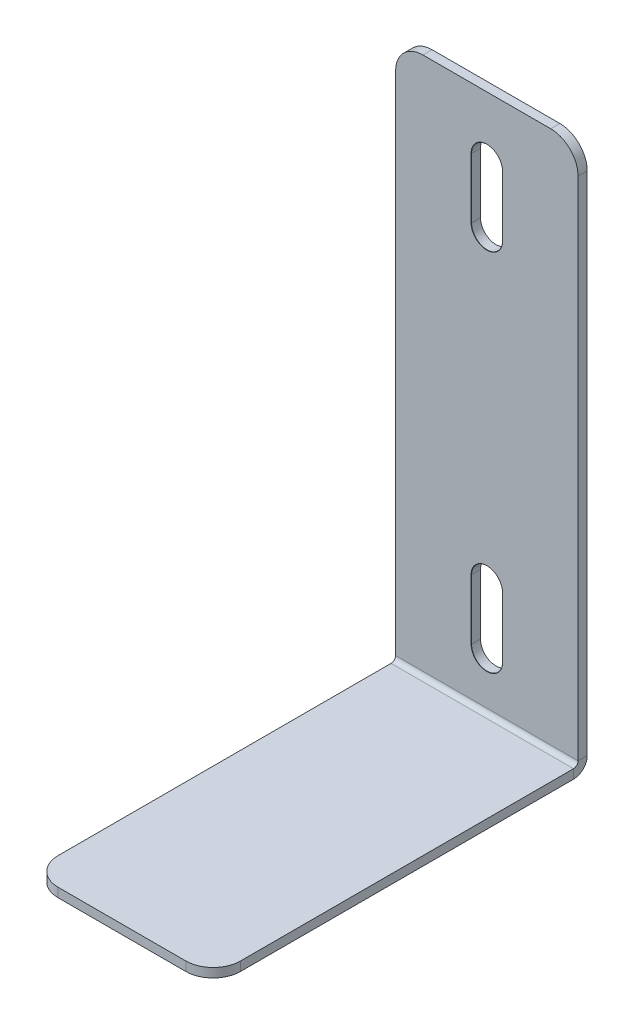
ISO-10303-21;
HEADER;
FILE_DESCRIPTION(('STEP AP214'),'2;1');
FILE_NAME('part.step','',(''),(''),'','','');
FILE_SCHEMA(('AUTOMOTIVE_DESIGN { 1 0 10303 214 1 1 1 1 }'));
ENDSEC;
DATA;
#1=APPLICATION_CONTEXT('core data for automotive mechanical design processes');
#2=APPLICATION_PROTOCOL_DEFINITION('international standard','automotive_design',2000,#1);
#3=PRODUCT_CONTEXT('',#1,'mechanical');
#4=PRODUCT('Part','Part','',(#3));
#5=PRODUCT_RELATED_PRODUCT_CATEGORY('part','',(#4));
#6=PRODUCT_DEFINITION_FORMATION('','',#4);
#7=PRODUCT_DEFINITION_CONTEXT('part definition',#1,'design');
#8=PRODUCT_DEFINITION('design','',#6,#7);
#9=PRODUCT_DEFINITION_SHAPE('','',#8);
#10=(LENGTH_UNIT() NAMED_UNIT(*) SI_UNIT(.MILLI.,.METRE.));
#11=(NAMED_UNIT(*) PLANE_ANGLE_UNIT() SI_UNIT($,.RADIAN.));
#12=(NAMED_UNIT(*) SI_UNIT($,.STERADIAN.) SOLID_ANGLE_UNIT());
#13=UNCERTAINTY_MEASURE_WITH_UNIT(LENGTH_MEASURE(1.E-05),#10,'distance_accuracy_value','');
#14=(GEOMETRIC_REPRESENTATION_CONTEXT(3) GLOBAL_UNCERTAINTY_ASSIGNED_CONTEXT((#13)) GLOBAL_UNIT_ASSIGNED_CONTEXT((#10,
#11,#12)) REPRESENTATION_CONTEXT('',''));
#15=CARTESIAN_POINT('',(0.,0.,0.));
#16=DIRECTION('',(0.,0.,1.));
#17=DIRECTION('',(1.,0.,0.));
#18=AXIS2_PLACEMENT_3D('',#15,#16,#17);
#19=CARTESIAN_POINT('',(0.,0.,0.));
#20=DIRECTION('',(0.,0.,1.));
#21=DIRECTION('',(1.,0.,0.));
#22=AXIS2_PLACEMENT_3D('',#19,#20,#21);
#23=PLANE('',#22);
#24=DIRECTION('',(0.,1.,0.));
#25=VECTOR('',#24,1.);
#26=CARTESIAN_POINT('',(-1.72500000000001,16.6999999999999,0.));
#27=LINE('',#26,#25);
#28=CARTESIAN_POINT('',(-1.72500000000006,16.6999999999999,0.));
#29=VERTEX_POINT('',#28);
#30=CARTESIAN_POINT('',(-1.72500000000001,23.2999999999999,0.));
#31=VERTEX_POINT('',#30);
#32=EDGE_CURVE('E403',#29,#31,#27,.T.);
#33=ORIENTED_EDGE('',*,*,#32,.T.);
#34=CARTESIAN_POINT('',(0.,23.2999999999999,0.));
#35=DIRECTION('',(0.,0.,1.));
#36=DIRECTION('',(1.,0.,0.));
#37=AXIS2_PLACEMENT_3D('',#34,#35,#36);
#38=CIRCLE('',#37,1.725);
#39=CARTESIAN_POINT('',(1.72499999999998,23.2999999999999,0.));
#40=VERTEX_POINT('',#39);
#41=EDGE_CURVE('E417',#40,#31,#38,.T.);
#42=ORIENTED_EDGE('',*,*,#41,.F.);
#43=DIRECTION('',(0.,1.,0.));
#44=VECTOR('',#43,1.);
#45=CARTESIAN_POINT('',(1.72499999999998,16.6999999999999,0.));
#46=LINE('',#45,#44);
#47=CARTESIAN_POINT('',(1.72499999999999,16.6999999999999,0.));
#48=VERTEX_POINT('',#47);
#49=EDGE_CURVE('E397',#48,#40,#46,.T.);
#50=ORIENTED_EDGE('',*,*,#49,.F.);
#51=CARTESIAN_POINT('',(0.,16.6999999999999,0.));
#52=DIRECTION('',(0.,0.,1.));
#53=DIRECTION('',(1.,0.,0.));
#54=AXIS2_PLACEMENT_3D('',#51,#52,#53);
#55=CIRCLE('',#54,1.725);
#56=EDGE_CURVE('E383',#29,#48,#55,.T.);
#57=ORIENTED_EDGE('',*,*,#56,.F.);
#58=EDGE_LOOP('',(#33,#42,#50,#57));
#59=FACE_BOUND('',#58,.T.);
#60=DIRECTION('',(0.,1.,0.));
#61=VECTOR('',#60,1.);
#62=CARTESIAN_POINT('',(9.99999999999999,30.,0.));
#63=LINE('',#62,#61);
#64=CARTESIAN_POINT('',(10.,-28.5,0.));
#65=VERTEX_POINT('',#64);
#66=CARTESIAN_POINT('',(9.99999999999999,27.,0.));
#67=VERTEX_POINT('',#66);
#68=EDGE_CURVE('E532',#65,#67,#63,.T.);
#69=ORIENTED_EDGE('',*,*,#68,.T.);
#70=CARTESIAN_POINT('',(6.99999999999999,27.,0.));
#71=DIRECTION('',(0.,0.,1.));
#72=DIRECTION('',(1.,0.,0.));
#73=AXIS2_PLACEMENT_3D('',#70,#71,#72);
#74=CIRCLE('',#73,3.);
#75=CARTESIAN_POINT('',(6.99999999999999,30.,0.));
#76=VERTEX_POINT('',#75);
#77=EDGE_CURVE('E573',#67,#76,#74,.T.);
#78=ORIENTED_EDGE('',*,*,#77,.T.);
#79=DIRECTION('',(-1.,0.,0.));
#80=VECTOR('',#79,1.);
#81=CARTESIAN_POINT('',(-10.,30.,0.));
#82=LINE('',#81,#80);
#83=CARTESIAN_POINT('',(-7.00000000000001,30.,0.));
#84=VERTEX_POINT('',#83);
#85=EDGE_CURVE('E547',#76,#84,#82,.T.);
#86=ORIENTED_EDGE('',*,*,#85,.T.);
#87=CARTESIAN_POINT('',(-7.00000000000001,27.,0.));
#88=DIRECTION('',(0.,0.,1.));
#89=DIRECTION('',(1.,0.,0.));
#90=AXIS2_PLACEMENT_3D('',#87,#88,#89);
#91=CIRCLE('',#90,3.);
#92=CARTESIAN_POINT('',(-10.,27.,0.));
#93=VERTEX_POINT('',#92);
#94=EDGE_CURVE('E571',#84,#93,#91,.T.);
#95=ORIENTED_EDGE('',*,*,#94,.T.);
#96=DIRECTION('',(0.,-1.,0.));
#97=VECTOR('',#96,1.);
#98=CARTESIAN_POINT('',(-10.,30.,0.));
#99=LINE('',#98,#97);
#100=CARTESIAN_POINT('',(-10.,-28.5,0.));
#101=VERTEX_POINT('',#100);
#102=EDGE_CURVE('E539',#93,#101,#99,.T.);
#103=ORIENTED_EDGE('',*,*,#102,.T.);
#104=DIRECTION('',(1.,0.,0.));
#105=VECTOR('',#104,1.);
#106=CARTESIAN_POINT('',(10.,-28.5,0.));
#107=LINE('',#106,#105);
#108=EDGE_CURVE('E524',#65,#101,#107,.F.);
#109=ORIENTED_EDGE('',*,*,#108,.F.);
#110=EDGE_LOOP('',(#69,#78,#86,#95,#103,#109));
#111=FACE_BOUND('',#110,.T.);
#112=CARTESIAN_POINT('',(0.,-23.3000000000001,0.));
#113=DIRECTION('',(0.,0.,1.));
#114=DIRECTION('',(1.,0.,0.));
#115=AXIS2_PLACEMENT_3D('',#112,#113,#114);
#116=CIRCLE('',#115,1.725);
#117=CARTESIAN_POINT('',(-1.72500000000006,-23.3000000000001,0.));
#118=VERTEX_POINT('',#117);
#119=CARTESIAN_POINT('',(1.72499999999999,-23.3000000000001,0.));
#120=VERTEX_POINT('',#119);
#121=EDGE_CURVE('E452',#118,#120,#116,.T.);
#122=ORIENTED_EDGE('',*,*,#121,.F.);
#123=DIRECTION('',(0.,1.,0.));
#124=VECTOR('',#123,1.);
#125=CARTESIAN_POINT('',(-1.72500000000001,-23.3000000000001,0.));
#126=LINE('',#125,#124);
#127=CARTESIAN_POINT('',(-1.72500000000001,-16.7000000000001,0.));
#128=VERTEX_POINT('',#127);
#129=EDGE_CURVE('E440',#118,#128,#126,.T.);
#130=ORIENTED_EDGE('',*,*,#129,.T.);
#131=CARTESIAN_POINT('',(0.,-16.7000000000001,0.));
#132=DIRECTION('',(0.,0.,1.));
#133=DIRECTION('',(1.,0.,0.));
#134=AXIS2_PLACEMENT_3D('',#131,#132,#133);
#135=CIRCLE('',#134,1.725);
#136=CARTESIAN_POINT('',(1.72499999999998,-16.7000000000001,0.));
#137=VERTEX_POINT('',#136);
#138=EDGE_CURVE('E472',#137,#128,#135,.T.);
#139=ORIENTED_EDGE('',*,*,#138,.F.);
#140=DIRECTION('',(0.,1.,0.));
#141=VECTOR('',#140,1.);
#142=CARTESIAN_POINT('',(1.72499999999998,-23.3000000000001,0.));
#143=LINE('',#142,#141);
#144=EDGE_CURVE('E428',#120,#137,#143,.T.);
#145=ORIENTED_EDGE('',*,*,#144,.F.);
#146=EDGE_LOOP('',(#122,#130,#139,#145));
#147=FACE_BOUND('',#146,.T.);
#148=ADVANCED_FACE('F213',(#59,#111,#147),#23,.T.);
#149=CARTESIAN_POINT('',(9.99999999999999,30.,-1.));
#150=DIRECTION('',(1.,0.,0.));
#151=DIRECTION('',(0.,1.,0.));
#152=AXIS2_PLACEMENT_3D('',#149,#150,#151);
#153=PLANE('',#152);
#154=DIRECTION('',(0.,1.,0.));
#155=VECTOR('',#154,1.);
#156=CARTESIAN_POINT('',(9.99999999999999,30.,-1.));
#157=LINE('',#156,#155);
#158=CARTESIAN_POINT('',(10.,-28.5,-1.));
#159=VERTEX_POINT('',#158);
#160=CARTESIAN_POINT('',(9.99999999999999,27.,-1.));
#161=VERTEX_POINT('',#160);
#162=EDGE_CURVE('E535',#159,#161,#157,.T.);
#163=ORIENTED_EDGE('',*,*,#162,.T.);
#164=DIRECTION('',(0.,0.,1.));
#165=VECTOR('',#164,1.);
#166=CARTESIAN_POINT('',(9.99999999999999,27.,-1.));
#167=LINE('',#166,#165);
#168=EDGE_CURVE('E568',#161,#67,#167,.T.);
#169=ORIENTED_EDGE('',*,*,#168,.T.);
#170=ORIENTED_EDGE('',*,*,#68,.F.);
#171=DIRECTION('',(0.,0.,-1.));
#172=VECTOR('',#171,1.);
#173=CARTESIAN_POINT('',(10.,-28.5,0.));
#174=LINE('',#173,#172);
#175=EDGE_CURVE('E518',#65,#159,#174,.T.);
#176=ORIENTED_EDGE('',*,*,#175,.T.);
#177=EDGE_LOOP('',(#163,#169,#170,#176));
#178=FACE_BOUND('',#177,.T.);
#179=ADVANCED_FACE('F589',(#178),#153,.T.);
#180=CARTESIAN_POINT('',(0.,0.,-1.));
#181=DIRECTION('',(0.,0.,1.));
#182=DIRECTION('',(1.,0.,0.));
#183=AXIS2_PLACEMENT_3D('',#180,#181,#182);
#184=PLANE('',#183);
#185=DIRECTION('',(0.,1.,0.));
#186=VECTOR('',#185,1.);
#187=CARTESIAN_POINT('',(-1.69999999999999,16.6999999999999,-1.));
#188=LINE('',#187,#186);
#189=CARTESIAN_POINT('',(-1.69999999999999,16.6999999999999,-1.));
#190=VERTEX_POINT('',#189);
#191=CARTESIAN_POINT('',(-1.7,23.2999999999999,-1.));
#192=VERTEX_POINT('',#191);
#193=EDGE_CURVE('E976',#190,#192,#188,.T.);
#194=ORIENTED_EDGE('',*,*,#193,.F.);
#195=CARTESIAN_POINT('',(0.,16.6999999999999,-1.));
#196=DIRECTION('',(0.,0.,1.));
#197=DIRECTION('',(1.,0.,0.));
#198=AXIS2_PLACEMENT_3D('',#195,#196,#197);
#199=CIRCLE('',#198,1.69999999999999);
#200=CARTESIAN_POINT('',(1.69999999999998,16.6999999999999,-1.));
#201=VERTEX_POINT('',#200);
#202=EDGE_CURVE('E236',#190,#201,#199,.T.);
#203=ORIENTED_EDGE('',*,*,#202,.T.);
#204=DIRECTION('',(0.,1.,0.));
#205=VECTOR('',#204,1.);
#206=CARTESIAN_POINT('',(1.69999999999998,16.6999999999999,-1.));
#207=LINE('',#206,#205);
#208=CARTESIAN_POINT('',(1.69999999999998,23.2999999999999,-1.));
#209=VERTEX_POINT('',#208);
#210=EDGE_CURVE('E382',#201,#209,#207,.T.);
#211=ORIENTED_EDGE('',*,*,#210,.T.);
#212=CARTESIAN_POINT('',(0.,23.2999999999999,-1.));
#213=DIRECTION('',(0.,0.,1.));
#214=DIRECTION('',(1.,0.,0.));
#215=AXIS2_PLACEMENT_3D('',#212,#213,#214);
#216=CIRCLE('',#215,1.69999999999999);
#217=EDGE_CURVE('E423',#209,#192,#216,.T.);
#218=ORIENTED_EDGE('',*,*,#217,.T.);
#219=EDGE_LOOP('',(#194,#203,#211,#218));
#220=FACE_BOUND('',#219,.T.);
#221=CARTESIAN_POINT('',(0.,-23.3000000000001,-1.));
#222=DIRECTION('',(0.,0.,1.));
#223=DIRECTION('',(1.,0.,0.));
#224=AXIS2_PLACEMENT_3D('',#221,#222,#223);
#225=CIRCLE('',#224,1.69999999999999);
#226=CARTESIAN_POINT('',(-1.69999999999999,-23.3000000000001,-1.));
#227=VERTEX_POINT('',#226);
#228=CARTESIAN_POINT('',(1.69999999999998,-23.3000000000001,-1.));
#229=VERTEX_POINT('',#228);
#230=EDGE_CURVE('E458',#227,#229,#225,.T.);
#231=ORIENTED_EDGE('',*,*,#230,.T.);
#232=DIRECTION('',(0.,1.,0.));
#233=VECTOR('',#232,1.);
#234=CARTESIAN_POINT('',(1.69999999999998,-23.3000000000001,-1.));
#235=LINE('',#234,#233);
#236=CARTESIAN_POINT('',(1.69999999999998,-16.7000000000001,-1.));
#237=VERTEX_POINT('',#236);
#238=EDGE_CURVE('E433',#229,#237,#235,.T.);
#239=ORIENTED_EDGE('',*,*,#238,.T.);
#240=CARTESIAN_POINT('',(0.,-16.7000000000001,-1.));
#241=DIRECTION('',(0.,0.,1.));
#242=DIRECTION('',(1.,0.,0.));
#243=AXIS2_PLACEMENT_3D('',#240,#241,#242);
#244=CIRCLE('',#243,1.69999999999999);
#245=CARTESIAN_POINT('',(-1.7,-16.7000000000001,-1.));
#246=VERTEX_POINT('',#245);
#247=EDGE_CURVE('E478',#237,#246,#244,.T.);
#248=ORIENTED_EDGE('',*,*,#247,.T.);
#249=DIRECTION('',(0.,1.,0.));
#250=VECTOR('',#249,1.);
#251=CARTESIAN_POINT('',(-1.69999999999999,-23.3000000000001,-1.));
#252=LINE('',#251,#250);
#253=EDGE_CURVE('E436',#227,#246,#252,.T.);
#254=ORIENTED_EDGE('',*,*,#253,.F.);
#255=EDGE_LOOP('',(#231,#239,#248,#254));
#256=FACE_BOUND('',#255,.T.);
#257=DIRECTION('',(-1.,0.,0.));
#258=VECTOR('',#257,1.);
#259=CARTESIAN_POINT('',(-10.,30.,-1.));
#260=LINE('',#259,#258);
#261=CARTESIAN_POINT('',(6.99999999999999,30.,-1.));
#262=VERTEX_POINT('',#261);
#263=CARTESIAN_POINT('',(-7.00000000000001,30.,-1.));
#264=VERTEX_POINT('',#263);
#265=EDGE_CURVE('E538',#262,#264,#260,.T.);
#266=ORIENTED_EDGE('',*,*,#265,.F.);
#267=CARTESIAN_POINT('',(6.99999999999999,27.,-1.));
#268=DIRECTION('',(0.,0.,1.));
#269=DIRECTION('',(1.,0.,0.));
#270=AXIS2_PLACEMENT_3D('',#267,#268,#269);
#271=CIRCLE('',#270,3.);
#272=EDGE_CURVE('E221',#262,#161,#271,.F.);
#273=ORIENTED_EDGE('',*,*,#272,.T.);
#274=ORIENTED_EDGE('',*,*,#162,.F.);
#275=DIRECTION('',(1.,0.,0.));
#276=VECTOR('',#275,1.);
#277=CARTESIAN_POINT('',(10.,-28.5,-1.));
#278=LINE('',#277,#276);
#279=CARTESIAN_POINT('',(-10.,-28.5,-1.));
#280=VERTEX_POINT('',#279);
#281=EDGE_CURVE('E511',#159,#280,#278,.F.);
#282=ORIENTED_EDGE('',*,*,#281,.T.);
#283=DIRECTION('',(0.,-1.,0.));
#284=VECTOR('',#283,1.);
#285=CARTESIAN_POINT('',(-10.,30.,-1.));
#286=LINE('',#285,#284);
#287=CARTESIAN_POINT('',(-10.,27.,-1.));
#288=VERTEX_POINT('',#287);
#289=EDGE_CURVE('E542',#288,#280,#286,.T.);
#290=ORIENTED_EDGE('',*,*,#289,.F.);
#291=CARTESIAN_POINT('',(-7.00000000000001,27.,-1.));
#292=DIRECTION('',(0.,0.,1.));
#293=DIRECTION('',(1.,0.,0.));
#294=AXIS2_PLACEMENT_3D('',#291,#292,#293);
#295=CIRCLE('',#294,3.);
#296=EDGE_CURVE('E580',#288,#264,#295,.F.);
#297=ORIENTED_EDGE('',*,*,#296,.T.);
#298=EDGE_LOOP('',(#266,#273,#274,#282,#290,#297));
#299=FACE_BOUND('',#298,.T.);
#300=ADVANCED_FACE('F584',(#220,#256,#299),#184,.F.);
#301=CARTESIAN_POINT('',(-10.,30.,-1.));
#302=DIRECTION('',(-1.,0.,0.));
#303=DIRECTION('',(0.,-1.,0.));
#304=AXIS2_PLACEMENT_3D('',#301,#302,#303);
#305=PLANE('',#304);
#306=ORIENTED_EDGE('',*,*,#102,.F.);
#307=DIRECTION('',(0.,0.,1.));
#308=VECTOR('',#307,1.);
#309=CARTESIAN_POINT('',(-10.,27.,-1.));
#310=LINE('',#309,#308);
#311=EDGE_CURVE('E14',#93,#288,#310,.F.);
#312=ORIENTED_EDGE('',*,*,#311,.T.);
#313=ORIENTED_EDGE('',*,*,#289,.T.);
#314=DIRECTION('',(0.,0.,-1.));
#315=VECTOR('',#314,1.);
#316=CARTESIAN_POINT('',(-10.,-28.5,0.));
#317=LINE('',#316,#315);
#318=EDGE_CURVE('E529',#101,#280,#317,.T.);
#319=ORIENTED_EDGE('',*,*,#318,.F.);
#320=EDGE_LOOP('',(#306,#312,#313,#319));
#321=FACE_BOUND('',#320,.T.);
#322=ADVANCED_FACE('F606',(#321),#305,.T.);
#323=CARTESIAN_POINT('',(-10.,30.,-1.));
#324=DIRECTION('',(0.,1.,0.));
#325=DIRECTION('',(0.,0.,1.));
#326=AXIS2_PLACEMENT_3D('',#323,#324,#325);
#327=PLANE('',#326);
#328=ORIENTED_EDGE('',*,*,#85,.F.);
#329=DIRECTION('',(0.,0.,1.));
#330=VECTOR('',#329,1.);
#331=CARTESIAN_POINT('',(6.99999999999999,30.,-1.));
#332=LINE('',#331,#330);
#333=EDGE_CURVE('E578',#76,#262,#332,.F.);
#334=ORIENTED_EDGE('',*,*,#333,.T.);
#335=ORIENTED_EDGE('',*,*,#265,.T.);
#336=DIRECTION('',(0.,0.,1.));
#337=VECTOR('',#336,1.);
#338=CARTESIAN_POINT('',(-7.00000000000001,30.,-1.));
#339=LINE('',#338,#337);
#340=EDGE_CURVE('E575',#264,#84,#339,.T.);
#341=ORIENTED_EDGE('',*,*,#340,.T.);
#342=EDGE_LOOP('',(#328,#334,#335,#341));
#343=FACE_BOUND('',#342,.T.);
#344=ADVANCED_FACE('F598',(#343),#327,.T.);
#345=CARTESIAN_POINT('',(-10.,-28.5,0.499999999999999));
#346=DIRECTION('',(-1.,0.,0.));
#347=DIRECTION('',(0.,0.,1.));
#348=AXIS2_PLACEMENT_3D('',#345,#346,#347);
#349=PLANE('',#348);
#350=DIRECTION('',(0.,1.,0.));
#351=VECTOR('',#350,1.);
#352=CARTESIAN_POINT('',(-10.,-30.,0.499999999999994));
#353=LINE('',#352,#351);
#354=CARTESIAN_POINT('',(-10.,-29.,0.499999999999997));
#355=VERTEX_POINT('',#354);
#356=CARTESIAN_POINT('',(-10.,-30.,0.499999999999994));
#357=VERTEX_POINT('',#356);
#358=EDGE_CURVE('E483',#355,#357,#353,.F.);
#359=ORIENTED_EDGE('',*,*,#358,.F.);
#360=CARTESIAN_POINT('',(-10.,-28.5,0.499999999999999));
#361=DIRECTION('',(1.,0.,0.));
#362=DIRECTION('',(0.,0.,-1.));
#363=AXIS2_PLACEMENT_3D('',#360,#361,#362);
#364=CIRCLE('',#363,0.5);
#365=EDGE_CURVE('E521',#101,#355,#364,.F.);
#366=ORIENTED_EDGE('',*,*,#365,.F.);
#367=ORIENTED_EDGE('',*,*,#318,.T.);
#368=CARTESIAN_POINT('',(-10.,-28.5,0.499999999999999));
#369=DIRECTION('',(1.,0.,0.));
#370=DIRECTION('',(0.,0.,-1.));
#371=AXIS2_PLACEMENT_3D('',#368,#369,#370);
#372=CIRCLE('',#371,1.5);
#373=EDGE_CURVE('E514',#280,#357,#372,.F.);
#374=ORIENTED_EDGE('',*,*,#373,.T.);
#375=EDGE_LOOP('',(#359,#366,#367,#374));
#376=FACE_BOUND('',#375,.T.);
#377=ADVANCED_FACE('F616',(#376),#349,.T.);
#378=CARTESIAN_POINT('',(10.,-28.5,0.499999999999999));
#379=DIRECTION('',(-1.,0.,0.));
#380=DIRECTION('',(0.,0.,1.));
#381=AXIS2_PLACEMENT_3D('',#378,#379,#380);
#382=PLANE('',#381);
#383=CARTESIAN_POINT('',(10.,-28.5,0.499999999999999));
#384=DIRECTION('',(1.,0.,0.));
#385=DIRECTION('',(0.,0.,-1.));
#386=AXIS2_PLACEMENT_3D('',#383,#384,#385);
#387=CIRCLE('',#386,0.5);
#388=CARTESIAN_POINT('',(10.,-29.,0.499999999999997));
#389=VERTEX_POINT('',#388);
#390=EDGE_CURVE('E486',#389,#65,#387,.T.);
#391=ORIENTED_EDGE('',*,*,#390,.F.);
#392=DIRECTION('',(0.,1.,0.));
#393=VECTOR('',#392,1.);
#394=CARTESIAN_POINT('',(10.,-29.,0.499999999999997));
#395=LINE('',#394,#393);
#396=CARTESIAN_POINT('',(10.,-30.,0.499999999999994));
#397=VERTEX_POINT('',#396);
#398=EDGE_CURVE('E504',#389,#397,#395,.F.);
#399=ORIENTED_EDGE('',*,*,#398,.T.);
#400=CARTESIAN_POINT('',(10.,-28.5,0.499999999999999));
#401=DIRECTION('',(1.,0.,0.));
#402=DIRECTION('',(0.,0.,-1.));
#403=AXIS2_PLACEMENT_3D('',#400,#401,#402);
#404=CIRCLE('',#403,1.5);
#405=EDGE_CURVE('E515',#397,#159,#404,.T.);
#406=ORIENTED_EDGE('',*,*,#405,.T.);
#407=ORIENTED_EDGE('',*,*,#175,.F.);
#408=EDGE_LOOP('',(#391,#399,#406,#407));
#409=FACE_BOUND('',#408,.T.);
#410=ADVANCED_FACE('F628',(#409),#382,.F.);
#411=CARTESIAN_POINT('',(10.,-28.5,0.499999999999999));
#412=DIRECTION('',(1.,0.,0.));
#413=DIRECTION('',(0.,-1.,0.));
#414=AXIS2_PLACEMENT_3D('',#411,#412,#413);
#415=CYLINDRICAL_SURFACE('',#414,1.5);
#416=ORIENTED_EDGE('',*,*,#281,.F.);
#417=ORIENTED_EDGE('',*,*,#405,.F.);
#418=DIRECTION('',(1.,0.,0.));
#419=VECTOR('',#418,1.);
#420=CARTESIAN_POINT('',(-10.,-30.,0.499999999999994));
#421=LINE('',#420,#419);
#422=EDGE_CURVE('E501',#397,#357,#421,.F.);
#423=ORIENTED_EDGE('',*,*,#422,.T.);
#424=ORIENTED_EDGE('',*,*,#373,.F.);
#425=EDGE_LOOP('',(#416,#417,#423,#424));
#426=FACE_BOUND('',#425,.T.);
#427=ADVANCED_FACE('F678',(#426),#415,.T.);
#428=CARTESIAN_POINT('',(10.,-28.5,0.499999999999999));
#429=DIRECTION('',(1.,0.,0.));
#430=DIRECTION('',(0.,-1.,0.));
#431=AXIS2_PLACEMENT_3D('',#428,#429,#430);
#432=CYLINDRICAL_SURFACE('',#431,0.5);
#433=ORIENTED_EDGE('',*,*,#108,.T.);
#434=ORIENTED_EDGE('',*,*,#365,.T.);
#435=DIRECTION('',(1.,0.,0.));
#436=VECTOR('',#435,1.);
#437=CARTESIAN_POINT('',(-10.,-29.,0.499999999999997));
#438=LINE('',#437,#436);
#439=EDGE_CURVE('E507',#355,#389,#438,.T.);
#440=ORIENTED_EDGE('',*,*,#439,.T.);
#441=ORIENTED_EDGE('',*,*,#390,.T.);
#442=EDGE_LOOP('',(#433,#434,#440,#441));
#443=FACE_BOUND('',#442,.T.);
#444=ADVANCED_FACE('F612',(#443),#432,.F.);
#445=CARTESIAN_POINT('',(10.,-30.0000000000001,40.));
#446=DIRECTION('',(-1.,0.,0.));
#447=DIRECTION('',(0.,0.,1.));
#448=AXIS2_PLACEMENT_3D('',#445,#446,#447);
#449=PLANE('',#448);
#450=DIRECTION('',(0.,0.,-1.));
#451=VECTOR('',#450,1.);
#452=CARTESIAN_POINT('',(10.,-29.0000000000001,40.));
#453=LINE('',#452,#451);
#454=CARTESIAN_POINT('',(10.,-29.0000000000001,37.));
#455=VERTEX_POINT('',#454);
#456=EDGE_CURVE('E498',#389,#455,#453,.F.);
#457=ORIENTED_EDGE('',*,*,#456,.T.);
#458=DIRECTION('',(0.,1.,0.));
#459=VECTOR('',#458,1.);
#460=CARTESIAN_POINT('',(10.,-30.0000000000001,37.));
#461=LINE('',#460,#459);
#462=CARTESIAN_POINT('',(10.,-30.0000000000001,37.));
#463=VERTEX_POINT('',#462);
#464=EDGE_CURVE('E559',#455,#463,#461,.F.);
#465=ORIENTED_EDGE('',*,*,#464,.T.);
#466=DIRECTION('',(0.,0.,1.));
#467=VECTOR('',#466,1.);
#468=CARTESIAN_POINT('',(10.,-30.,-1.08008570766446E-13));
#469=LINE('',#468,#467);
#470=EDGE_CURVE('E490',#397,#463,#469,.T.);
#471=ORIENTED_EDGE('',*,*,#470,.F.);
#472=ORIENTED_EDGE('',*,*,#398,.F.);
#473=EDGE_LOOP('',(#457,#465,#471,#472));
#474=FACE_BOUND('',#473,.T.);
#475=ADVANCED_FACE('F632',(#474),#449,.F.);
#476=CARTESIAN_POINT('',(-10.,-30.,0.));
#477=DIRECTION('',(1.,0.,0.));
#478=DIRECTION('',(0.,0.,-1.));
#479=AXIS2_PLACEMENT_3D('',#476,#477,#478);
#480=PLANE('',#479);
#481=DIRECTION('',(0.,0.,-1.));
#482=VECTOR('',#481,1.);
#483=CARTESIAN_POINT('',(-10.,-30.,-1.05840166421475E-13));
#484=LINE('',#483,#482);
#485=CARTESIAN_POINT('',(-9.99999999999999,-30.0000000000001,37.));
#486=VERTEX_POINT('',#485);
#487=EDGE_CURVE('E484',#486,#357,#484,.T.);
#488=ORIENTED_EDGE('',*,*,#487,.F.);
#489=DIRECTION('',(0.,1.,0.));
#490=VECTOR('',#489,1.);
#491=CARTESIAN_POINT('',(-9.99999999999999,-30.0000000000001,37.));
#492=LINE('',#491,#490);
#493=CARTESIAN_POINT('',(-9.99999999999999,-29.0000000000001,37.));
#494=VERTEX_POINT('',#493);
#495=EDGE_CURVE('E565',#486,#494,#492,.T.);
#496=ORIENTED_EDGE('',*,*,#495,.T.);
#497=DIRECTION('',(0.,0.,1.));
#498=VECTOR('',#497,1.);
#499=CARTESIAN_POINT('',(-10.,-29.,0.));
#500=LINE('',#499,#498);
#501=EDGE_CURVE('E493',#494,#355,#500,.F.);
#502=ORIENTED_EDGE('',*,*,#501,.T.);
#503=ORIENTED_EDGE('',*,*,#358,.T.);
#504=EDGE_LOOP('',(#488,#496,#502,#503));
#505=FACE_BOUND('',#504,.T.);
#506=ADVANCED_FACE('F619',(#505),#480,.F.);
#507=CARTESIAN_POINT('',(0.,-30.,-1.07574889897452E-13));
#508=DIRECTION('',(0.,1.,0.));
#509=DIRECTION('',(0.,0.,1.));
#510=AXIS2_PLACEMENT_3D('',#507,#508,#509);
#511=PLANE('',#510);
#512=ORIENTED_EDGE('',*,*,#470,.T.);
#513=CARTESIAN_POINT('',(7.,-30.0000000000001,37.));
#514=DIRECTION('',(0.,1.,0.));
#515=DIRECTION('',(0.,0.,1.));
#516=AXIS2_PLACEMENT_3D('',#513,#514,#515);
#517=CIRCLE('',#516,3.);
#518=CARTESIAN_POINT('',(7.,-30.0000000000001,40.));
#519=VERTEX_POINT('',#518);
#520=EDGE_CURVE('E563',#463,#519,#517,.F.);
#521=ORIENTED_EDGE('',*,*,#520,.T.);
#522=DIRECTION('',(-1.,0.,0.));
#523=VECTOR('',#522,1.);
#524=CARTESIAN_POINT('',(0.,-30.0000000000001,40.));
#525=LINE('',#524,#523);
#526=CARTESIAN_POINT('',(-7.,-30.0000000000001,40.));
#527=VERTEX_POINT('',#526);
#528=EDGE_CURVE('E487',#519,#527,#525,.T.);
#529=ORIENTED_EDGE('',*,*,#528,.T.);
#530=CARTESIAN_POINT('',(-7.,-30.0000000000001,37.));
#531=DIRECTION('',(0.,1.,0.));
#532=DIRECTION('',(0.,0.,1.));
#533=AXIS2_PLACEMENT_3D('',#530,#531,#532);
#534=CIRCLE('',#533,3.);
#535=EDGE_CURVE('E561',#527,#486,#534,.F.);
#536=ORIENTED_EDGE('',*,*,#535,.T.);
#537=ORIENTED_EDGE('',*,*,#487,.T.);
#538=ORIENTED_EDGE('',*,*,#422,.F.);
#539=EDGE_LOOP('',(#512,#521,#529,#536,#537,#538));
#540=FACE_BOUND('',#539,.T.);
#541=ADVANCED_FACE('F636',(#540),#511,.F.);
#542=CARTESIAN_POINT('',(0.,-29.,-1.04083408558608E-13));
#543=DIRECTION('',(0.,1.,0.));
#544=DIRECTION('',(0.,0.,1.));
#545=AXIS2_PLACEMENT_3D('',#542,#543,#544);
#546=PLANE('',#545);
#547=DIRECTION('',(1.,0.,0.));
#548=VECTOR('',#547,1.);
#549=CARTESIAN_POINT('',(-9.99999999999999,-29.0000000000001,40.));
#550=LINE('',#549,#548);
#551=CARTESIAN_POINT('',(7.,-29.0000000000001,40.));
#552=VERTEX_POINT('',#551);
#553=CARTESIAN_POINT('',(-7.,-29.0000000000001,40.));
#554=VERTEX_POINT('',#553);
#555=EDGE_CURVE('E495',#552,#554,#550,.F.);
#556=ORIENTED_EDGE('',*,*,#555,.F.);
#557=CARTESIAN_POINT('',(7.,-29.0000000000001,37.));
#558=DIRECTION('',(0.,1.,0.));
#559=DIRECTION('',(0.,0.,1.));
#560=AXIS2_PLACEMENT_3D('',#557,#558,#559);
#561=CIRCLE('',#560,3.);
#562=EDGE_CURVE('E557',#552,#455,#561,.T.);
#563=ORIENTED_EDGE('',*,*,#562,.T.);
#564=ORIENTED_EDGE('',*,*,#456,.F.);
#565=ORIENTED_EDGE('',*,*,#439,.F.);
#566=ORIENTED_EDGE('',*,*,#501,.F.);
#567=CARTESIAN_POINT('',(-7.,-29.0000000000001,37.));
#568=DIRECTION('',(0.,1.,0.));
#569=DIRECTION('',(0.,0.,1.));
#570=AXIS2_PLACEMENT_3D('',#567,#568,#569);
#571=CIRCLE('',#570,3.);
#572=EDGE_CURVE('E555',#494,#554,#571,.T.);
#573=ORIENTED_EDGE('',*,*,#572,.T.);
#574=EDGE_LOOP('',(#556,#563,#564,#565,#566,#573));
#575=FACE_BOUND('',#574,.T.);
#576=ADVANCED_FACE('F624',(#575),#546,.T.);
#577=CARTESIAN_POINT('',(-9.99999999999999,-30.0000000000001,40.));
#578=DIRECTION('',(0.,0.,-1.));
#579=DIRECTION('',(0.,1.,0.));
#580=AXIS2_PLACEMENT_3D('',#577,#578,#579);
#581=PLANE('',#580);
#582=ORIENTED_EDGE('',*,*,#528,.F.);
#583=DIRECTION('',(0.,1.,0.));
#584=VECTOR('',#583,1.);
#585=CARTESIAN_POINT('',(7.,-30.0000000000001,40.));
#586=LINE('',#585,#584);
#587=EDGE_CURVE('E552',#519,#552,#586,.T.);
#588=ORIENTED_EDGE('',*,*,#587,.T.);
#589=ORIENTED_EDGE('',*,*,#555,.T.);
#590=DIRECTION('',(0.,1.,0.));
#591=VECTOR('',#590,1.);
#592=CARTESIAN_POINT('',(-7.,-30.0000000000001,40.));
#593=LINE('',#592,#591);
#594=EDGE_CURVE('E544',#554,#527,#593,.F.);
#595=ORIENTED_EDGE('',*,*,#594,.T.);
#596=EDGE_LOOP('',(#582,#588,#589,#595));
#597=FACE_BOUND('',#596,.T.);
#598=ADVANCED_FACE('F642',(#597),#581,.F.);
#599=CARTESIAN_POINT('',(7.,-30.0000000000001,37.));
#600=DIRECTION('',(0.,1.,0.));
#601=DIRECTION('',(0.,0.,1.));
#602=AXIS2_PLACEMENT_3D('',#599,#600,#601);
#603=CYLINDRICAL_SURFACE('',#602,3.);
#604=ORIENTED_EDGE('',*,*,#520,.F.);
#605=ORIENTED_EDGE('',*,*,#464,.F.);
#606=ORIENTED_EDGE('',*,*,#562,.F.);
#607=ORIENTED_EDGE('',*,*,#587,.F.);
#608=EDGE_LOOP('',(#604,#605,#606,#607));
#609=FACE_BOUND('',#608,.T.);
#610=ADVANCED_FACE('F640',(#609),#603,.T.);
#611=CARTESIAN_POINT('',(-7.,-30.0000000000001,37.));
#612=DIRECTION('',(0.,1.,0.));
#613=DIRECTION('',(0.,0.,1.));
#614=AXIS2_PLACEMENT_3D('',#611,#612,#613);
#615=CYLINDRICAL_SURFACE('',#614,3.);
#616=ORIENTED_EDGE('',*,*,#535,.F.);
#617=ORIENTED_EDGE('',*,*,#594,.F.);
#618=ORIENTED_EDGE('',*,*,#572,.F.);
#619=ORIENTED_EDGE('',*,*,#495,.F.);
#620=EDGE_LOOP('',(#616,#617,#618,#619));
#621=FACE_BOUND('',#620,.T.);
#622=ADVANCED_FACE('F646',(#621),#615,.T.);
#623=CARTESIAN_POINT('',(6.99999999999999,27.,-1.));
#624=DIRECTION('',(0.,0.,1.));
#625=DIRECTION('',(1.,0.,0.));
#626=AXIS2_PLACEMENT_3D('',#623,#624,#625);
#627=CYLINDRICAL_SURFACE('',#626,3.);
#628=ORIENTED_EDGE('',*,*,#272,.F.);
#629=ORIENTED_EDGE('',*,*,#333,.F.);
#630=ORIENTED_EDGE('',*,*,#77,.F.);
#631=ORIENTED_EDGE('',*,*,#168,.F.);
#632=EDGE_LOOP('',(#628,#629,#630,#631));
#633=FACE_BOUND('',#632,.T.);
#634=ADVANCED_FACE('F593',(#633),#627,.T.);
#635=CARTESIAN_POINT('',(-7.00000000000001,27.,-1.));
#636=DIRECTION('',(0.,0.,1.));
#637=DIRECTION('',(1.,0.,0.));
#638=AXIS2_PLACEMENT_3D('',#635,#636,#637);
#639=CYLINDRICAL_SURFACE('',#638,3.);
#640=ORIENTED_EDGE('',*,*,#296,.F.);
#641=ORIENTED_EDGE('',*,*,#311,.F.);
#642=ORIENTED_EDGE('',*,*,#94,.F.);
#643=ORIENTED_EDGE('',*,*,#340,.F.);
#644=EDGE_LOOP('',(#640,#641,#642,#643));
#645=FACE_BOUND('',#644,.T.);
#646=ADVANCED_FACE('F215',(#645),#639,.T.);
#647=CARTESIAN_POINT('',(0.,-16.7000000000001,0.));
#648=DIRECTION('',(0.,0.,1.));
#649=DIRECTION('',(1.,0.,0.));
#650=AXIS2_PLACEMENT_3D('',#647,#648,#649);
#651=CYLINDRICAL_SURFACE('',#650,1.69999999999999);
#652=ORIENTED_EDGE('',*,*,#247,.F.);
#653=DIRECTION('',(0.,0.,-1.));
#654=VECTOR('',#653,1.);
#655=CARTESIAN_POINT('',(1.69999999999998,-16.7000000000001,-1.));
#656=LINE('',#655,#654);
#657=CARTESIAN_POINT('',(1.69999999999998,-16.7000000000001,-0.025000000000025));
#658=VERTEX_POINT('',#657);
#659=EDGE_CURVE('E469',#658,#237,#656,.T.);
#660=ORIENTED_EDGE('',*,*,#659,.F.);
#661=CARTESIAN_POINT('',(0.,-16.7000000000001,-0.025000000000025));
#662=DIRECTION('',(0.,0.,1.));
#663=DIRECTION('',(1.,0.,0.));
#664=AXIS2_PLACEMENT_3D('',#661,#662,#663);
#665=CIRCLE('',#664,1.69999999999999);
#666=CARTESIAN_POINT('',(-1.7,-16.7000000000001,-0.0250000000000248));
#667=VERTEX_POINT('',#666);
#668=EDGE_CURVE('E475',#658,#667,#665,.T.);
#669=ORIENTED_EDGE('',*,*,#668,.T.);
#670=DIRECTION('',(0.,0.,1.));
#671=VECTOR('',#670,1.);
#672=CARTESIAN_POINT('',(-1.7,-16.7000000000001,0.));
#673=LINE('',#672,#671);
#674=EDGE_CURVE('E463',#246,#667,#673,.T.);
#675=ORIENTED_EDGE('',*,*,#674,.F.);
#676=EDGE_LOOP('',(#652,#660,#669,#675));
#677=FACE_BOUND('',#676,.T.);
#678=ADVANCED_FACE('F694',(#677),#651,.F.);
#679=CARTESIAN_POINT('',(0.,-16.7000000000001,0.));
#680=DIRECTION('',(0.,0.,1.));
#681=DIRECTION('',(1.,0.,0.));
#682=AXIS2_PLACEMENT_3D('',#679,#680,#681);
#683=CONICAL_SURFACE('',#682,1.725,0.785398163397171);
#684=ORIENTED_EDGE('',*,*,#668,.F.);
#685=DIRECTION('',(-0.707106781186351,0.,-0.707106781186744));
#686=VECTOR('',#685,1.);
#687=CARTESIAN_POINT('',(1.69999999999998,-16.7000000000001,-0.025000000000025));
#688=LINE('',#687,#686);
#689=EDGE_CURVE('E466',#137,#658,#688,.T.);
#690=ORIENTED_EDGE('',*,*,#689,.F.);
#691=ORIENTED_EDGE('',*,*,#138,.T.);
#692=DIRECTION('',(0.707106781186351,0.,-0.707106781186744));
#693=VECTOR('',#692,1.);
#694=CARTESIAN_POINT('',(0.,-16.7000000000001,-1.72500000000096));
#695=LINE('',#694,#693);
#696=EDGE_CURVE('E481',#667,#128,#695,.F.);
#697=ORIENTED_EDGE('',*,*,#696,.F.);
#698=EDGE_LOOP('',(#684,#690,#691,#697));
#699=FACE_BOUND('',#698,.T.);
#700=ADVANCED_FACE('F697',(#699),#683,.F.);
#701=CARTESIAN_POINT('',(0.,-23.3000000000001,0.));
#702=DIRECTION('',(0.,0.,1.));
#703=DIRECTION('',(1.,0.,0.));
#704=AXIS2_PLACEMENT_3D('',#701,#702,#703);
#705=CYLINDRICAL_SURFACE('',#704,1.69999999999999);
#706=CARTESIAN_POINT('',(0.,-23.3000000000001,-0.025000000000025));
#707=DIRECTION('',(0.,0.,1.));
#708=DIRECTION('',(1.,0.,0.));
#709=AXIS2_PLACEMENT_3D('',#706,#707,#708);
#710=CIRCLE('',#709,1.69999999999999);
#711=CARTESIAN_POINT('',(-1.69999999999999,-23.3000000000001,-0.025000000000025));
#712=VERTEX_POINT('',#711);
#713=CARTESIAN_POINT('',(1.69999999999998,-23.3000000000001,-0.025000000000025));
#714=VERTEX_POINT('',#713);
#715=EDGE_CURVE('E455',#712,#714,#710,.T.);
#716=ORIENTED_EDGE('',*,*,#715,.T.);
#717=DIRECTION('',(0.,0.,-1.));
#718=VECTOR('',#717,1.);
#719=CARTESIAN_POINT('',(1.69999999999998,-23.3000000000001,-1.));
#720=LINE('',#719,#718);
#721=EDGE_CURVE('E449',#714,#229,#720,.T.);
#722=ORIENTED_EDGE('',*,*,#721,.T.);
#723=ORIENTED_EDGE('',*,*,#230,.F.);
#724=DIRECTION('',(0.,0.,1.));
#725=VECTOR('',#724,1.);
#726=CARTESIAN_POINT('',(-1.69999999999999,-23.3000000000001,0.));
#727=LINE('',#726,#725);
#728=EDGE_CURVE('E443',#712,#227,#727,.F.);
#729=ORIENTED_EDGE('',*,*,#728,.F.);
#730=EDGE_LOOP('',(#716,#722,#723,#729));
#731=FACE_BOUND('',#730,.T.);
#732=ADVANCED_FACE('F701',(#731),#705,.F.);
#733=CARTESIAN_POINT('',(0.,-23.3000000000001,0.));
#734=DIRECTION('',(0.,0.,1.));
#735=DIRECTION('',(1.,0.,0.));
#736=AXIS2_PLACEMENT_3D('',#733,#734,#735);
#737=CONICAL_SURFACE('',#736,1.725,0.785398163397171);
#738=ORIENTED_EDGE('',*,*,#121,.T.);
#739=DIRECTION('',(-0.707106781186351,0.,-0.707106781186744));
#740=VECTOR('',#739,1.);
#741=CARTESIAN_POINT('',(1.69999999999998,-23.3000000000001,-0.025000000000025));
#742=LINE('',#741,#740);
#743=EDGE_CURVE('E446',#120,#714,#742,.T.);
#744=ORIENTED_EDGE('',*,*,#743,.T.);
#745=ORIENTED_EDGE('',*,*,#715,.F.);
#746=DIRECTION('',(-0.707106781186351,0.,0.707106781186744));
#747=VECTOR('',#746,1.);
#748=CARTESIAN_POINT('',(0.,-23.3000000000001,-1.72500000000096));
#749=LINE('',#748,#747);
#750=EDGE_CURVE('E461',#118,#712,#749,.F.);
#751=ORIENTED_EDGE('',*,*,#750,.F.);
#752=EDGE_LOOP('',(#738,#744,#745,#751));
#753=FACE_BOUND('',#752,.T.);
#754=ADVANCED_FACE('F705',(#753),#737,.F.);
#755=CARTESIAN_POINT('',(0.,-23.3000000000001,-1.72500000000096));
#756=DIRECTION('',(-0.707106781186744,0.,-0.707106781186351));
#757=DIRECTION('',(-0.707106781186351,0.,0.707106781186744));
#758=AXIS2_PLACEMENT_3D('',#755,#756,#757);
#759=PLANE('',#758);
#760=ORIENTED_EDGE('',*,*,#696,.T.);
#761=ORIENTED_EDGE('',*,*,#129,.F.);
#762=ORIENTED_EDGE('',*,*,#750,.T.);
#763=DIRECTION('',(0.,1.,0.));
#764=VECTOR('',#763,1.);
#765=CARTESIAN_POINT('',(-1.69999999999999,-23.3000000000001,-0.0250000000000248));
#766=LINE('',#765,#764);
#767=EDGE_CURVE('E438',#712,#667,#766,.T.);
#768=ORIENTED_EDGE('',*,*,#767,.T.);
#769=EDGE_LOOP('',(#760,#761,#762,#768));
#770=FACE_BOUND('',#769,.T.);
#771=ADVANCED_FACE('F709',(#770),#759,.F.);
#772=CARTESIAN_POINT('',(-1.69999999999999,-23.3000000000001,0.));
#773=DIRECTION('',(-1.,0.,0.));
#774=DIRECTION('',(0.,-1.,0.));
#775=AXIS2_PLACEMENT_3D('',#772,#773,#774);
#776=PLANE('',#775);
#777=ORIENTED_EDGE('',*,*,#674,.T.);
#778=ORIENTED_EDGE('',*,*,#767,.F.);
#779=ORIENTED_EDGE('',*,*,#728,.T.);
#780=ORIENTED_EDGE('',*,*,#253,.T.);
#781=EDGE_LOOP('',(#777,#778,#779,#780));
#782=FACE_BOUND('',#781,.T.);
#783=ADVANCED_FACE('F713',(#782),#776,.F.);
#784=CARTESIAN_POINT('',(1.69999999999998,-23.3000000000001,-1.));
#785=DIRECTION('',(1.,0.,0.));
#786=DIRECTION('',(0.,1.,0.));
#787=AXIS2_PLACEMENT_3D('',#784,#785,#786);
#788=PLANE('',#787);
#789=ORIENTED_EDGE('',*,*,#659,.T.);
#790=ORIENTED_EDGE('',*,*,#238,.F.);
#791=ORIENTED_EDGE('',*,*,#721,.F.);
#792=DIRECTION('',(0.,1.,0.));
#793=VECTOR('',#792,1.);
#794=CARTESIAN_POINT('',(1.69999999999998,-23.3000000000001,-0.025000000000025));
#795=LINE('',#794,#793);
#796=EDGE_CURVE('E430',#714,#658,#795,.T.);
#797=ORIENTED_EDGE('',*,*,#796,.T.);
#798=EDGE_LOOP('',(#789,#790,#791,#797));
#799=FACE_BOUND('',#798,.T.);
#800=ADVANCED_FACE('F717',(#799),#788,.F.);
#801=CARTESIAN_POINT('',(1.69999999999998,-23.3000000000001,-0.025000000000025));
#802=DIRECTION('',(0.707106781186744,0.,-0.707106781186351));
#803=DIRECTION('',(-0.707106781186351,0.,-0.707106781186744));
#804=AXIS2_PLACEMENT_3D('',#801,#802,#803);
#805=PLANE('',#804);
#806=ORIENTED_EDGE('',*,*,#689,.T.);
#807=ORIENTED_EDGE('',*,*,#796,.F.);
#808=ORIENTED_EDGE('',*,*,#743,.F.);
#809=ORIENTED_EDGE('',*,*,#144,.T.);
#810=EDGE_LOOP('',(#806,#807,#808,#809));
#811=FACE_BOUND('',#810,.T.);
#812=ADVANCED_FACE('F721',(#811),#805,.F.);
#813=CARTESIAN_POINT('',(0.,23.2999999999999,0.));
#814=DIRECTION('',(0.,0.,1.));
#815=DIRECTION('',(1.,0.,0.));
#816=AXIS2_PLACEMENT_3D('',#813,#814,#815);
#817=CYLINDRICAL_SURFACE('',#816,1.69999999999999);
#818=ORIENTED_EDGE('',*,*,#217,.F.);
#819=DIRECTION('',(0.,0.,-1.));
#820=VECTOR('',#819,1.);
#821=CARTESIAN_POINT('',(1.69999999999998,23.2999999999999,-1.));
#822=LINE('',#821,#820);
#823=CARTESIAN_POINT('',(1.69999999999998,23.2999999999999,-0.025000000000025));
#824=VERTEX_POINT('',#823);
#825=EDGE_CURVE('E415',#824,#209,#822,.T.);
#826=ORIENTED_EDGE('',*,*,#825,.F.);
#827=CARTESIAN_POINT('',(0.,23.2999999999999,-0.025000000000025));
#828=DIRECTION('',(0.,0.,1.));
#829=DIRECTION('',(1.,0.,0.));
#830=AXIS2_PLACEMENT_3D('',#827,#828,#829);
#831=CIRCLE('',#830,1.69999999999999);
#832=CARTESIAN_POINT('',(-1.7,23.2999999999999,-0.0250000000000248));
#833=VERTEX_POINT('',#832);
#834=EDGE_CURVE('E420',#824,#833,#831,.T.);
#835=ORIENTED_EDGE('',*,*,#834,.T.);
#836=DIRECTION('',(0.,0.,1.));
#837=VECTOR('',#836,1.);
#838=CARTESIAN_POINT('',(-1.7,23.2999999999999,0.));
#839=LINE('',#838,#837);
#840=EDGE_CURVE('E411',#192,#833,#839,.T.);
#841=ORIENTED_EDGE('',*,*,#840,.F.);
#842=EDGE_LOOP('',(#818,#826,#835,#841));
#843=FACE_BOUND('',#842,.T.);
#844=ADVANCED_FACE('F725',(#843),#817,.F.);
#845=CARTESIAN_POINT('',(0.,23.2999999999999,0.));
#846=DIRECTION('',(0.,0.,1.));
#847=DIRECTION('',(1.,0.,0.));
#848=AXIS2_PLACEMENT_3D('',#845,#846,#847);
#849=CONICAL_SURFACE('',#848,1.725,0.785398163397171);
#850=ORIENTED_EDGE('',*,*,#834,.F.);
#851=DIRECTION('',(-0.707106781186351,0.,-0.707106781186744));
#852=VECTOR('',#851,1.);
#853=CARTESIAN_POINT('',(1.69999999999998,23.2999999999999,-0.025000000000025));
#854=LINE('',#853,#852);
#855=EDGE_CURVE('E396',#40,#824,#854,.T.);
#856=ORIENTED_EDGE('',*,*,#855,.F.);
#857=ORIENTED_EDGE('',*,*,#41,.T.);
#858=DIRECTION('',(0.707106781186351,0.,-0.707106781186744));
#859=VECTOR('',#858,1.);
#860=CARTESIAN_POINT('',(0.,23.2999999999999,-1.72500000000096));
#861=LINE('',#860,#859);
#862=EDGE_CURVE('E426',#833,#31,#861,.F.);
#863=ORIENTED_EDGE('',*,*,#862,.F.);
#864=EDGE_LOOP('',(#850,#856,#857,#863));
#865=FACE_BOUND('',#864,.T.);
#866=ADVANCED_FACE('F729',(#865),#849,.F.);
#867=CARTESIAN_POINT('',(0.,16.6999999999999,0.));
#868=DIRECTION('',(0.,0.,1.));
#869=DIRECTION('',(1.,0.,0.));
#870=AXIS2_PLACEMENT_3D('',#867,#868,#869);
#871=CYLINDRICAL_SURFACE('',#870,1.69999999999999);
#872=CARTESIAN_POINT('',(0.,16.6999999999999,-0.025000000000025));
#873=DIRECTION('',(0.,0.,1.));
#874=DIRECTION('',(1.,0.,0.));
#875=AXIS2_PLACEMENT_3D('',#872,#873,#874);
#876=CIRCLE('',#875,1.69999999999999);
#877=CARTESIAN_POINT('',(-1.69999999999999,16.6999999999999,-0.025000000000025));
#878=VERTEX_POINT('',#877);
#879=CARTESIAN_POINT('',(1.69999999999998,16.6999999999999,-0.025000000000025));
#880=VERTEX_POINT('',#879);
#881=EDGE_CURVE('E386',#878,#880,#876,.T.);
#882=ORIENTED_EDGE('',*,*,#881,.T.);
#883=DIRECTION('',(0.,0.,-1.));
#884=VECTOR('',#883,1.);
#885=CARTESIAN_POINT('',(1.69999999999998,16.6999999999999,-1.));
#886=LINE('',#885,#884);
#887=EDGE_CURVE('E375',#880,#201,#886,.T.);
#888=ORIENTED_EDGE('',*,*,#887,.T.);
#889=ORIENTED_EDGE('',*,*,#202,.F.);
#890=DIRECTION('',(0.,0.,1.));
#891=VECTOR('',#890,1.);
#892=CARTESIAN_POINT('',(-1.69999999999999,16.6999999999999,0.));
#893=LINE('',#892,#891);
#894=EDGE_CURVE('E388',#878,#190,#893,.F.);
#895=ORIENTED_EDGE('',*,*,#894,.F.);
#896=EDGE_LOOP('',(#882,#888,#889,#895));
#897=FACE_BOUND('',#896,.T.);
#898=ADVANCED_FACE('F387',(#897),#871,.F.);
#899=CARTESIAN_POINT('',(0.,16.6999999999999,0.));
#900=DIRECTION('',(0.,0.,1.));
#901=DIRECTION('',(1.,0.,0.));
#902=AXIS2_PLACEMENT_3D('',#899,#900,#901);
#903=CONICAL_SURFACE('',#902,1.725,0.785398163397171);
#904=ORIENTED_EDGE('',*,*,#56,.T.);
#905=DIRECTION('',(-0.707106781186351,0.,-0.707106781186744));
#906=VECTOR('',#905,1.);
#907=CARTESIAN_POINT('',(1.69999999999998,16.6999999999999,-0.025000000000025));
#908=LINE('',#907,#906);
#909=EDGE_CURVE('E228',#48,#880,#908,.T.);
#910=ORIENTED_EDGE('',*,*,#909,.T.);
#911=ORIENTED_EDGE('',*,*,#881,.F.);
#912=DIRECTION('',(-0.707106781186351,0.,0.707106781186744));
#913=VECTOR('',#912,1.);
#914=CARTESIAN_POINT('',(0.,16.6999999999999,-1.72500000000096));
#915=LINE('',#914,#913);
#916=EDGE_CURVE('E409',#29,#878,#915,.F.);
#917=ORIENTED_EDGE('',*,*,#916,.F.);
#918=EDGE_LOOP('',(#904,#910,#911,#917));
#919=FACE_BOUND('',#918,.T.);
#920=ADVANCED_FACE('F399',(#919),#903,.F.);
#921=CARTESIAN_POINT('',(0.,16.6999999999999,-1.72500000000096));
#922=DIRECTION('',(-0.707106781186744,0.,-0.707106781186351));
#923=DIRECTION('',(-0.707106781186351,0.,0.707106781186744));
#924=AXIS2_PLACEMENT_3D('',#921,#922,#923);
#925=PLANE('',#924);
#926=ORIENTED_EDGE('',*,*,#862,.T.);
#927=ORIENTED_EDGE('',*,*,#32,.F.);
#928=ORIENTED_EDGE('',*,*,#916,.T.);
#929=DIRECTION('',(0.,1.,0.));
#930=VECTOR('',#929,1.);
#931=CARTESIAN_POINT('',(-1.69999999999999,16.6999999999999,-0.0250000000000248));
#932=LINE('',#931,#930);
#933=EDGE_CURVE('E991',#878,#833,#932,.T.);
#934=ORIENTED_EDGE('',*,*,#933,.T.);
#935=EDGE_LOOP('',(#926,#927,#928,#934));
#936=FACE_BOUND('',#935,.T.);
#937=ADVANCED_FACE('F738',(#936),#925,.F.);
#938=CARTESIAN_POINT('',(-1.69999999999999,16.6999999999999,0.));
#939=DIRECTION('',(-1.,0.,0.));
#940=DIRECTION('',(0.,-1.,0.));
#941=AXIS2_PLACEMENT_3D('',#938,#939,#940);
#942=PLANE('',#941);
#943=ORIENTED_EDGE('',*,*,#840,.T.);
#944=ORIENTED_EDGE('',*,*,#933,.F.);
#945=ORIENTED_EDGE('',*,*,#894,.T.);
#946=ORIENTED_EDGE('',*,*,#193,.T.);
#947=EDGE_LOOP('',(#943,#944,#945,#946));
#948=FACE_BOUND('',#947,.T.);
#949=ADVANCED_FACE('F741',(#948),#942,.F.);
#950=CARTESIAN_POINT('',(1.69999999999998,16.6999999999999,-1.));
#951=DIRECTION('',(1.,0.,0.));
#952=DIRECTION('',(0.,1.,0.));
#953=AXIS2_PLACEMENT_3D('',#950,#951,#952);
#954=PLANE('',#953);
#955=ORIENTED_EDGE('',*,*,#825,.T.);
#956=ORIENTED_EDGE('',*,*,#210,.F.);
#957=ORIENTED_EDGE('',*,*,#887,.F.);
#958=DIRECTION('',(0.,1.,0.));
#959=VECTOR('',#958,1.);
#960=CARTESIAN_POINT('',(1.69999999999998,16.6999999999999,-0.025000000000025));
#961=LINE('',#960,#959);
#962=EDGE_CURVE('E379',#880,#824,#961,.T.);
#963=ORIENTED_EDGE('',*,*,#962,.T.);
#964=EDGE_LOOP('',(#955,#956,#957,#963));
#965=FACE_BOUND('',#964,.T.);
#966=ADVANCED_FACE('F378',(#965),#954,.F.);
#967=CARTESIAN_POINT('',(1.69999999999998,16.6999999999999,-0.025000000000025));
#968=DIRECTION('',(0.707106781186744,0.,-0.707106781186351));
#969=DIRECTION('',(-0.707106781186351,0.,-0.707106781186744));
#970=AXIS2_PLACEMENT_3D('',#967,#968,#969);
#971=PLANE('',#970);
#972=ORIENTED_EDGE('',*,*,#855,.T.);
#973=ORIENTED_EDGE('',*,*,#962,.F.);
#974=ORIENTED_EDGE('',*,*,#909,.F.);
#975=ORIENTED_EDGE('',*,*,#49,.T.);
#976=EDGE_LOOP('',(#972,#973,#974,#975));
#977=FACE_BOUND('',#976,.T.);
#978=ADVANCED_FACE('F394',(#977),#971,.F.);
#979=CLOSED_SHELL('',(#148,#179,#300,#322,#344,#377,#410,#427,#444,#475,#506,#541,#576,#598,
#610,#622,#634,#646,#678,#700,#732,#754,#771,#783,#800,#812,#844,#866,#898,#920,#937,#949,#966,#978));
#980=MANIFOLD_SOLID_BREP('B2',#979);
#981=ADVANCED_BREP_SHAPE_REPRESENTATION('',(#18,#980),#14);
#982=SHAPE_DEFINITION_REPRESENTATION(#9,#981);
ENDSEC;
END-ISO-10303-21;
